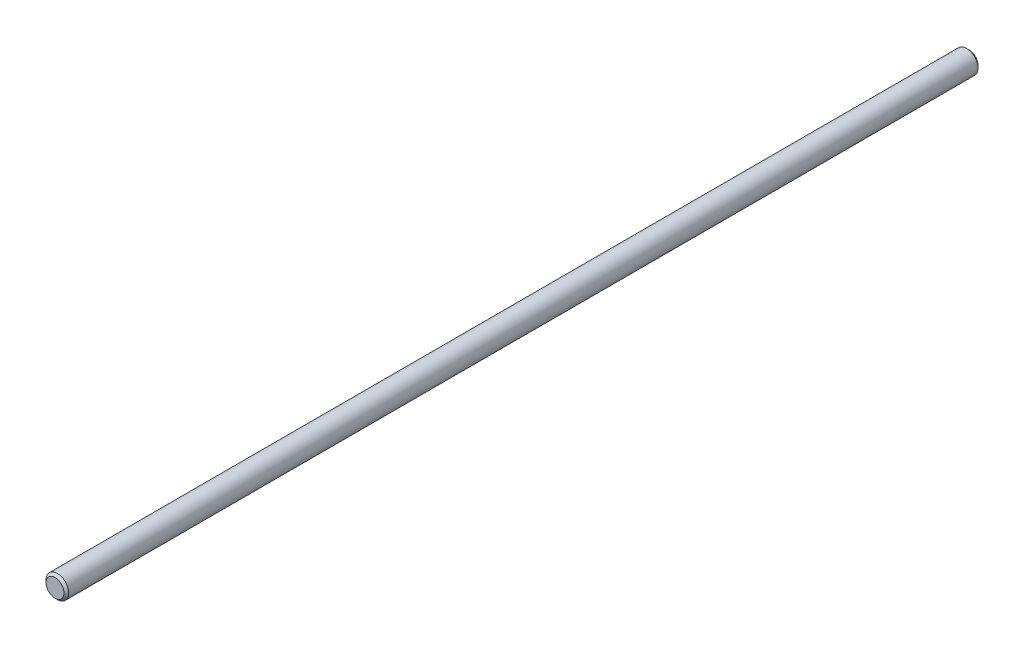
ISO-10303-21;
HEADER;
FILE_DESCRIPTION(('STEP AP214'),'2;1');
FILE_NAME('part.step','',(''),(''),'','','');
FILE_SCHEMA(('AUTOMOTIVE_DESIGN { 1 0 10303 214 1 1 1 1 }'));
ENDSEC;
DATA;
#1=APPLICATION_CONTEXT('core data for automotive mechanical design processes');
#2=APPLICATION_PROTOCOL_DEFINITION('international standard','automotive_design',2000,#1);
#3=PRODUCT_CONTEXT('',#1,'mechanical');
#4=PRODUCT('Part','Part','',(#3));
#5=PRODUCT_RELATED_PRODUCT_CATEGORY('part','',(#4));
#6=PRODUCT_DEFINITION_FORMATION('','',#4);
#7=PRODUCT_DEFINITION_CONTEXT('part definition',#1,'design');
#8=PRODUCT_DEFINITION('design','',#6,#7);
#9=PRODUCT_DEFINITION_SHAPE('','',#8);
#10=(LENGTH_UNIT() NAMED_UNIT(*) SI_UNIT(.MILLI.,.METRE.));
#11=(NAMED_UNIT(*) PLANE_ANGLE_UNIT() SI_UNIT($,.RADIAN.));
#12=(NAMED_UNIT(*) SI_UNIT($,.STERADIAN.) SOLID_ANGLE_UNIT());
#13=UNCERTAINTY_MEASURE_WITH_UNIT(LENGTH_MEASURE(1.E-05),#10,'distance_accuracy_value','');
#14=(GEOMETRIC_REPRESENTATION_CONTEXT(3) GLOBAL_UNCERTAINTY_ASSIGNED_CONTEXT((#13)) GLOBAL_UNIT_ASSIGNED_CONTEXT((#10,
#11,#12)) REPRESENTATION_CONTEXT('',''));
#15=CARTESIAN_POINT('',(0.,0.,0.));
#16=DIRECTION('',(0.,0.,1.));
#17=DIRECTION('',(1.,0.,0.));
#18=AXIS2_PLACEMENT_3D('',#15,#16,#17);
#19=CARTESIAN_POINT('',(0.,0.,194.5));
#20=DIRECTION('',(0.,0.,-1.));
#21=DIRECTION('',(-1.,0.,0.));
#22=AXIS2_PLACEMENT_3D('',#19,#20,#21);
#23=CYLINDRICAL_SURFACE('',#22,4.826);
#24=CARTESIAN_POINT('',(0.,0.,-193.5));
#25=DIRECTION('',(0.,0.,1.));
#26=DIRECTION('',(1.,0.,0.));
#27=AXIS2_PLACEMENT_3D('',#24,#25,#26);
#28=CIRCLE('',#27,4.826);
#29=CARTESIAN_POINT('',(4.826,0.,-193.5));
#30=VERTEX_POINT('',#29);
#31=EDGE_CURVE('E41',#30,#30,#28,.T.);
#32=ORIENTED_EDGE('',*,*,#31,.T.);
#33=EDGE_LOOP('',(#32));
#34=FACE_BOUND('',#33,.T.);
#35=CARTESIAN_POINT('',(0.,0.,193.5));
#36=DIRECTION('',(0.,0.,1.));
#37=DIRECTION('',(1.,0.,0.));
#38=AXIS2_PLACEMENT_3D('',#35,#36,#37);
#39=CIRCLE('',#38,4.826);
#40=CARTESIAN_POINT('',(4.826,0.,193.5));
#41=VERTEX_POINT('',#40);
#42=EDGE_CURVE('E45',#41,#41,#39,.F.);
#43=ORIENTED_EDGE('',*,*,#42,.T.);
#44=EDGE_LOOP('',(#43));
#45=FACE_BOUND('',#44,.T.);
#46=ADVANCED_FACE('F30',(#34,#45),#23,.T.);
#47=CARTESIAN_POINT('',(0.,0.,194.5));
#48=DIRECTION('',(0.,0.,1.));
#49=DIRECTION('',(1.,0.,0.));
#50=AXIS2_PLACEMENT_3D('',#47,#48,#49);
#51=PLANE('',#50);
#52=CARTESIAN_POINT('',(0.,0.,194.5));
#53=DIRECTION('',(0.,0.,1.));
#54=DIRECTION('',(1.,0.,0.));
#55=AXIS2_PLACEMENT_3D('',#52,#53,#54);
#56=CIRCLE('',#55,3.82600000000005);
#57=CARTESIAN_POINT('',(3.82600000000005,0.,194.5));
#58=VERTEX_POINT('',#57);
#59=EDGE_CURVE('E10',#58,#58,#56,.T.);
#60=ORIENTED_EDGE('',*,*,#59,.T.);
#61=EDGE_LOOP('',(#60));
#62=FACE_BOUND('',#61,.T.);
#63=ADVANCED_FACE('F61',(#62),#51,.T.);
#64=CARTESIAN_POINT('',(0.,0.,-194.5));
#65=DIRECTION('',(0.,0.,1.));
#66=DIRECTION('',(1.,0.,0.));
#67=AXIS2_PLACEMENT_3D('',#64,#65,#66);
#68=PLANE('',#67);
#69=CARTESIAN_POINT('',(0.,0.,-194.5));
#70=DIRECTION('',(0.,0.,1.));
#71=DIRECTION('',(1.,0.,0.));
#72=AXIS2_PLACEMENT_3D('',#69,#70,#71);
#73=CIRCLE('',#72,3.82599999999994);
#74=CARTESIAN_POINT('',(3.82599999999994,0.,-194.5));
#75=VERTEX_POINT('',#74);
#76=EDGE_CURVE('E37',#75,#75,#73,.F.);
#77=ORIENTED_EDGE('',*,*,#76,.T.);
#78=EDGE_LOOP('',(#77));
#79=FACE_BOUND('',#78,.T.);
#80=ADVANCED_FACE('F58',(#79),#68,.F.);
#81=CARTESIAN_POINT('',(0.,0.,-193.5));
#82=DIRECTION('',(0.,0.,1.));
#83=DIRECTION('',(1.,0.,0.));
#84=AXIS2_PLACEMENT_3D('',#81,#82,#83);
#85=CONICAL_SURFACE('',#84,4.826,0.785398163397422);
#86=ORIENTED_EDGE('',*,*,#76,.F.);
#87=EDGE_LOOP('',(#86));
#88=FACE_BOUND('',#87,.T.);
#89=ORIENTED_EDGE('',*,*,#31,.F.);
#90=EDGE_LOOP('',(#89));
#91=FACE_BOUND('',#90,.T.);
#92=ADVANCED_FACE('F54',(#88,#91),#85,.T.);
#93=CARTESIAN_POINT('',(0.,0.,194.5));
#94=DIRECTION('',(0.,0.,-1.));
#95=DIRECTION('',(-1.,0.,0.));
#96=AXIS2_PLACEMENT_3D('',#93,#94,#95);
#97=CONICAL_SURFACE('',#96,3.82600000000005,0.785398163397436);
#98=ORIENTED_EDGE('',*,*,#42,.F.);
#99=EDGE_LOOP('',(#98));
#100=FACE_BOUND('',#99,.T.);
#101=ORIENTED_EDGE('',*,*,#59,.F.);
#102=EDGE_LOOP('',(#101));
#103=FACE_BOUND('',#102,.T.);
#104=ADVANCED_FACE('F32',(#100,#103),#97,.T.);
#105=CLOSED_SHELL('',(#46,#63,#80,#92,#104));
#106=MANIFOLD_SOLID_BREP('B2',#105);
#107=ADVANCED_BREP_SHAPE_REPRESENTATION('',(#18,#106),#14);
#108=SHAPE_DEFINITION_REPRESENTATION(#9,#107);
ENDSEC;
END-ISO-10303-21;
